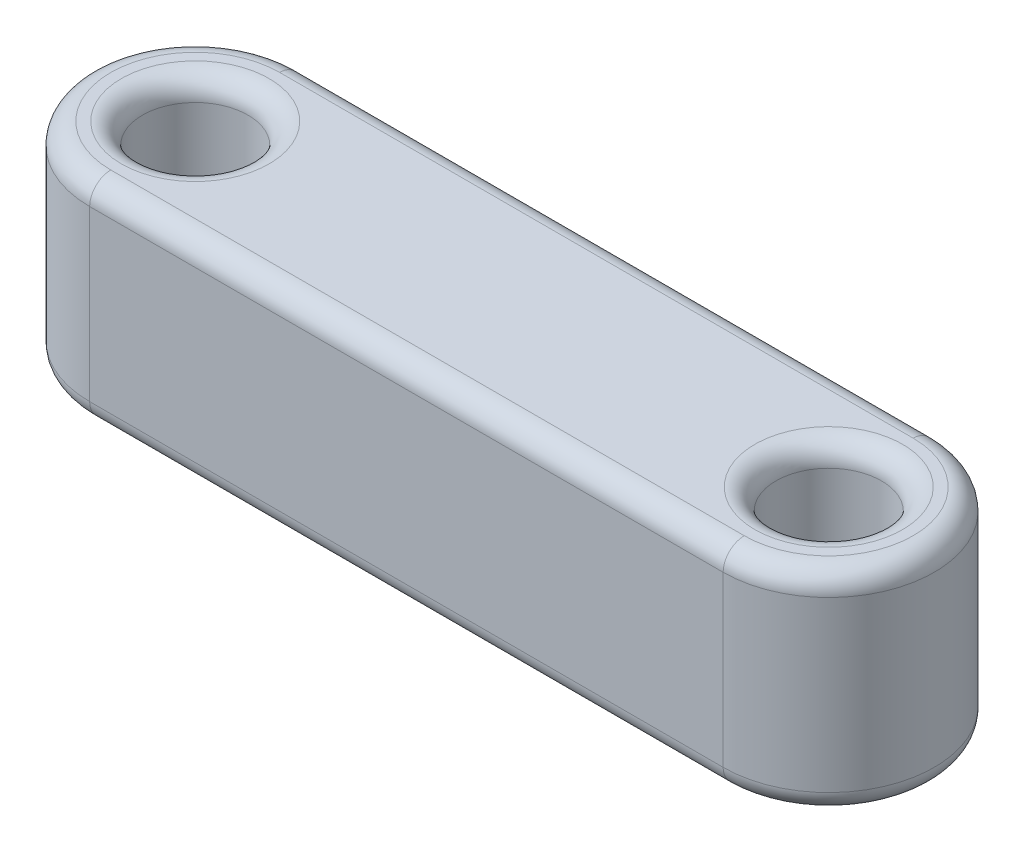
ISO-10303-21;
HEADER;
FILE_DESCRIPTION(('STEP AP214'),'2;1');
FILE_NAME('part.step','',(''),(''),'','','');
FILE_SCHEMA(('AUTOMOTIVE_DESIGN { 1 0 10303 214 1 1 1 1 }'));
ENDSEC;
DATA;
#1=APPLICATION_CONTEXT('core data for automotive mechanical design processes');
#2=APPLICATION_PROTOCOL_DEFINITION('international standard','automotive_design',2000,#1);
#3=PRODUCT_CONTEXT('',#1,'mechanical');
#4=PRODUCT('Part','Part','',(#3));
#5=PRODUCT_RELATED_PRODUCT_CATEGORY('part','',(#4));
#6=PRODUCT_DEFINITION_FORMATION('','',#4);
#7=PRODUCT_DEFINITION_CONTEXT('part definition',#1,'design');
#8=PRODUCT_DEFINITION('design','',#6,#7);
#9=PRODUCT_DEFINITION_SHAPE('','',#8);
#10=(LENGTH_UNIT() NAMED_UNIT(*) SI_UNIT(.MILLI.,.METRE.));
#11=(NAMED_UNIT(*) PLANE_ANGLE_UNIT() SI_UNIT($,.RADIAN.));
#12=(NAMED_UNIT(*) SI_UNIT($,.STERADIAN.) SOLID_ANGLE_UNIT());
#13=UNCERTAINTY_MEASURE_WITH_UNIT(LENGTH_MEASURE(1.E-05),#10,'distance_accuracy_value','');
#14=(GEOMETRIC_REPRESENTATION_CONTEXT(3) GLOBAL_UNCERTAINTY_ASSIGNED_CONTEXT((#13)) GLOBAL_UNIT_ASSIGNED_CONTEXT((#10,
#11,#12)) REPRESENTATION_CONTEXT('',''));
#15=CARTESIAN_POINT('',(0.,0.,0.));
#16=DIRECTION('',(0.,0.,1.));
#17=DIRECTION('',(1.,0.,0.));
#18=AXIS2_PLACEMENT_3D('',#15,#16,#17);
#19=CARTESIAN_POINT('',(0.,10.,0.));
#20=DIRECTION('',(0.,1.,0.));
#21=DIRECTION('',(0.,0.,1.));
#22=AXIS2_PLACEMENT_3D('',#19,#20,#21);
#23=PLANE('',#22);
#24=CARTESIAN_POINT('',(30.,10.,0.));
#25=DIRECTION('',(0.,1.,0.));
#26=DIRECTION('',(0.,0.,1.));
#27=AXIS2_PLACEMENT_3D('',#24,#25,#26);
#28=CIRCLE('',#27,3.5);
#29=CARTESIAN_POINT('',(30.,10.,3.5));
#30=VERTEX_POINT('',#29);
#31=EDGE_CURVE('E11',#30,#30,#28,.F.);
#32=ORIENTED_EDGE('',*,*,#31,.T.);
#33=EDGE_LOOP('',(#32));
#34=FACE_BOUND('',#33,.T.);
#35=CARTESIAN_POINT('',(30.,10.,0.));
#36=DIRECTION('',(0.,1.,0.));
#37=DIRECTION('',(0.,0.,1.));
#38=AXIS2_PLACEMENT_3D('',#35,#36,#37);
#39=CIRCLE('',#38,4.);
#40=CARTESIAN_POINT('',(30.,10.,4.));
#41=VERTEX_POINT('',#40);
#42=CARTESIAN_POINT('',(30.,10.,-4.));
#43=VERTEX_POINT('',#42);
#44=EDGE_CURVE('E57',#41,#43,#39,.T.);
#45=ORIENTED_EDGE('',*,*,#44,.T.);
#46=DIRECTION('',(-1.,0.,0.));
#47=VECTOR('',#46,1.);
#48=CARTESIAN_POINT('',(0.,10.,-4.));
#49=LINE('',#48,#47);
#50=CARTESIAN_POINT('',(0.,10.,-4.));
#51=VERTEX_POINT('',#50);
#52=EDGE_CURVE('E49',#43,#51,#49,.T.);
#53=ORIENTED_EDGE('',*,*,#52,.T.);
#54=CARTESIAN_POINT('',(0.,10.,0.));
#55=DIRECTION('',(0.,1.,0.));
#56=DIRECTION('',(0.,0.,1.));
#57=AXIS2_PLACEMENT_3D('',#54,#55,#56);
#58=CIRCLE('',#57,4.);
#59=CARTESIAN_POINT('',(0.,10.,4.));
#60=VERTEX_POINT('',#59);
#61=EDGE_CURVE('E194',#51,#60,#58,.T.);
#62=ORIENTED_EDGE('',*,*,#61,.T.);
#63=DIRECTION('',(1.,0.,0.));
#64=VECTOR('',#63,1.);
#65=CARTESIAN_POINT('',(30.,10.,4.));
#66=LINE('',#65,#64);
#67=EDGE_CURVE('E62',#60,#41,#66,.T.);
#68=ORIENTED_EDGE('',*,*,#67,.T.);
#69=EDGE_LOOP('',(#45,#53,#62,#68));
#70=FACE_BOUND('',#69,.T.);
#71=CARTESIAN_POINT('',(0.,10.,0.));
#72=DIRECTION('',(0.,1.,0.));
#73=DIRECTION('',(0.,0.,1.));
#74=AXIS2_PLACEMENT_3D('',#71,#72,#73);
#75=CIRCLE('',#74,3.5);
#76=CARTESIAN_POINT('',(0.,10.,3.5));
#77=VERTEX_POINT('',#76);
#78=EDGE_CURVE('E190',#77,#77,#75,.F.);
#79=ORIENTED_EDGE('',*,*,#78,.T.);
#80=EDGE_LOOP('',(#79));
#81=FACE_BOUND('',#80,.T.);
#82=ADVANCED_FACE('F39',(#34,#70,#81),#23,.T.);
#83=CARTESIAN_POINT('',(0.,0.,0.));
#84=DIRECTION('',(0.,1.,0.));
#85=DIRECTION('',(0.,0.,1.));
#86=AXIS2_PLACEMENT_3D('',#83,#84,#85);
#87=PLANE('',#86);
#88=CARTESIAN_POINT('',(30.,0.,0.));
#89=DIRECTION('',(0.,1.,0.));
#90=DIRECTION('',(0.,0.,1.));
#91=AXIS2_PLACEMENT_3D('',#88,#89,#90);
#92=CIRCLE('',#91,3.5);
#93=CARTESIAN_POINT('',(30.,0.,3.5));
#94=VERTEX_POINT('',#93);
#95=EDGE_CURVE('E142',#94,#94,#92,.T.);
#96=ORIENTED_EDGE('',*,*,#95,.T.);
#97=EDGE_LOOP('',(#96));
#98=FACE_BOUND('',#97,.T.);
#99=CARTESIAN_POINT('',(0.,0.,0.));
#100=DIRECTION('',(0.,1.,0.));
#101=DIRECTION('',(0.,0.,1.));
#102=AXIS2_PLACEMENT_3D('',#99,#100,#101);
#103=CIRCLE('',#102,3.5);
#104=CARTESIAN_POINT('',(0.,0.,3.5));
#105=VERTEX_POINT('',#104);
#106=EDGE_CURVE('E137',#105,#105,#103,.T.);
#107=ORIENTED_EDGE('',*,*,#106,.T.);
#108=EDGE_LOOP('',(#107));
#109=FACE_BOUND('',#108,.T.);
#110=CARTESIAN_POINT('',(30.,0.,0.));
#111=DIRECTION('',(0.,1.,0.));
#112=DIRECTION('',(0.,0.,1.));
#113=AXIS2_PLACEMENT_3D('',#110,#111,#112);
#114=CIRCLE('',#113,4.);
#115=CARTESIAN_POINT('',(30.,0.,-4.));
#116=VERTEX_POINT('',#115);
#117=CARTESIAN_POINT('',(30.,0.,4.));
#118=VERTEX_POINT('',#117);
#119=EDGE_CURVE('E135',#116,#118,#114,.F.);
#120=ORIENTED_EDGE('',*,*,#119,.T.);
#121=DIRECTION('',(1.,0.,0.));
#122=VECTOR('',#121,1.);
#123=CARTESIAN_POINT('',(0.,0.,4.));
#124=LINE('',#123,#122);
#125=CARTESIAN_POINT('',(0.,0.,4.));
#126=VERTEX_POINT('',#125);
#127=EDGE_CURVE('E112',#118,#126,#124,.F.);
#128=ORIENTED_EDGE('',*,*,#127,.T.);
#129=CARTESIAN_POINT('',(0.,0.,0.));
#130=DIRECTION('',(0.,1.,0.));
#131=DIRECTION('',(0.,0.,1.));
#132=AXIS2_PLACEMENT_3D('',#129,#130,#131);
#133=CIRCLE('',#132,4.);
#134=CARTESIAN_POINT('',(0.,0.,-4.));
#135=VERTEX_POINT('',#134);
#136=EDGE_CURVE('E123',#126,#135,#133,.F.);
#137=ORIENTED_EDGE('',*,*,#136,.T.);
#138=DIRECTION('',(-1.,0.,0.));
#139=VECTOR('',#138,1.);
#140=CARTESIAN_POINT('',(0.,0.,-4.));
#141=LINE('',#140,#139);
#142=EDGE_CURVE('E130',#135,#116,#141,.F.);
#143=ORIENTED_EDGE('',*,*,#142,.T.);
#144=EDGE_LOOP('',(#120,#128,#137,#143));
#145=FACE_BOUND('',#144,.T.);
#146=ADVANCED_FACE('F133',(#98,#109,#145),#87,.F.);
#147=CARTESIAN_POINT('',(0.,10.,0.));
#148=DIRECTION('',(0.,-1.,0.));
#149=DIRECTION('',(0.,0.,-1.));
#150=AXIS2_PLACEMENT_3D('',#147,#148,#149);
#151=CYLINDRICAL_SURFACE('',#150,5.);
#152=DIRECTION('',(0.,-1.,0.));
#153=VECTOR('',#152,1.);
#154=CARTESIAN_POINT('',(0.,10.,-5.));
#155=LINE('',#154,#153);
#156=CARTESIAN_POINT('',(0.,9.,-5.));
#157=VERTEX_POINT('',#156);
#158=CARTESIAN_POINT('',(0.,0.999999999999999,-5.));
#159=VERTEX_POINT('',#158);
#160=EDGE_CURVE('E210',#157,#159,#155,.T.);
#161=ORIENTED_EDGE('',*,*,#160,.T.);
#162=CARTESIAN_POINT('',(0.,0.999999999999999,0.));
#163=DIRECTION('',(0.,1.,0.));
#164=DIRECTION('',(0.,0.,1.));
#165=AXIS2_PLACEMENT_3D('',#162,#163,#164);
#166=CIRCLE('',#165,5.);
#167=CARTESIAN_POINT('',(0.,0.999999999999999,5.));
#168=VERTEX_POINT('',#167);
#169=EDGE_CURVE('E187',#159,#168,#166,.T.);
#170=ORIENTED_EDGE('',*,*,#169,.T.);
#171=DIRECTION('',(0.,-1.,0.));
#172=VECTOR('',#171,1.);
#173=CARTESIAN_POINT('',(0.,10.,5.));
#174=LINE('',#173,#172);
#175=CARTESIAN_POINT('',(0.,9.,5.));
#176=VERTEX_POINT('',#175);
#177=EDGE_CURVE('E131',#176,#168,#174,.T.);
#178=ORIENTED_EDGE('',*,*,#177,.F.);
#179=CARTESIAN_POINT('',(0.,9.,0.));
#180=DIRECTION('',(0.,1.,0.));
#181=DIRECTION('',(0.,0.,1.));
#182=AXIS2_PLACEMENT_3D('',#179,#180,#181);
#183=CIRCLE('',#182,5.);
#184=EDGE_CURVE('E184',#176,#157,#183,.F.);
#185=ORIENTED_EDGE('',*,*,#184,.T.);
#186=EDGE_LOOP('',(#161,#170,#178,#185));
#187=FACE_BOUND('',#186,.T.);
#188=ADVANCED_FACE('F240',(#187),#151,.T.);
#189=CARTESIAN_POINT('',(0.,10.,5.));
#190=DIRECTION('',(0.,0.,-1.));
#191=DIRECTION('',(-1.,0.,0.));
#192=AXIS2_PLACEMENT_3D('',#189,#190,#191);
#193=PLANE('',#192);
#194=ORIENTED_EDGE('',*,*,#177,.T.);
#195=DIRECTION('',(1.,0.,0.));
#196=VECTOR('',#195,1.);
#197=CARTESIAN_POINT('',(0.,0.999999999999999,5.));
#198=LINE('',#197,#196);
#199=CARTESIAN_POINT('',(30.,0.999999999999999,5.));
#200=VERTEX_POINT('',#199);
#201=EDGE_CURVE('E115',#168,#200,#198,.T.);
#202=ORIENTED_EDGE('',*,*,#201,.T.);
#203=DIRECTION('',(0.,-1.,0.));
#204=VECTOR('',#203,1.);
#205=CARTESIAN_POINT('',(30.,10.,5.));
#206=LINE('',#205,#204);
#207=CARTESIAN_POINT('',(30.,9.,5.));
#208=VERTEX_POINT('',#207);
#209=EDGE_CURVE('E237',#208,#200,#206,.T.);
#210=ORIENTED_EDGE('',*,*,#209,.F.);
#211=DIRECTION('',(1.,0.,0.));
#212=VECTOR('',#211,1.);
#213=CARTESIAN_POINT('',(0.,9.,5.));
#214=LINE('',#213,#212);
#215=EDGE_CURVE('E166',#208,#176,#214,.F.);
#216=ORIENTED_EDGE('',*,*,#215,.T.);
#217=EDGE_LOOP('',(#194,#202,#210,#216));
#218=FACE_BOUND('',#217,.T.);
#219=ADVANCED_FACE('F235',(#218),#193,.F.);
#220=CARTESIAN_POINT('',(30.,10.,0.));
#221=DIRECTION('',(0.,-1.,0.));
#222=DIRECTION('',(0.,0.,-1.));
#223=AXIS2_PLACEMENT_3D('',#220,#221,#222);
#224=CYLINDRICAL_SURFACE('',#223,5.);
#225=ORIENTED_EDGE('',*,*,#209,.T.);
#226=CARTESIAN_POINT('',(30.,0.999999999999999,0.));
#227=DIRECTION('',(0.,1.,0.));
#228=DIRECTION('',(0.,0.,1.));
#229=AXIS2_PLACEMENT_3D('',#226,#227,#228);
#230=CIRCLE('',#229,5.);
#231=CARTESIAN_POINT('',(30.,0.999999999999999,-5.));
#232=VERTEX_POINT('',#231);
#233=EDGE_CURVE('E174',#200,#232,#230,.T.);
#234=ORIENTED_EDGE('',*,*,#233,.T.);
#235=DIRECTION('',(0.,-1.,0.));
#236=VECTOR('',#235,1.);
#237=CARTESIAN_POINT('',(30.,10.,-5.));
#238=LINE('',#237,#236);
#239=CARTESIAN_POINT('',(30.,9.,-5.));
#240=VERTEX_POINT('',#239);
#241=EDGE_CURVE('E245',#240,#232,#238,.T.);
#242=ORIENTED_EDGE('',*,*,#241,.F.);
#243=CARTESIAN_POINT('',(30.,9.,0.));
#244=DIRECTION('',(0.,1.,0.));
#245=DIRECTION('',(0.,0.,1.));
#246=AXIS2_PLACEMENT_3D('',#243,#244,#245);
#247=CIRCLE('',#246,5.);
#248=EDGE_CURVE('E171',#240,#208,#247,.F.);
#249=ORIENTED_EDGE('',*,*,#248,.T.);
#250=EDGE_LOOP('',(#225,#234,#242,#249));
#251=FACE_BOUND('',#250,.T.);
#252=ADVANCED_FACE('F259',(#251),#224,.T.);
#253=CARTESIAN_POINT('',(0.,10.,-5.));
#254=DIRECTION('',(0.,0.,1.));
#255=DIRECTION('',(1.,0.,0.));
#256=AXIS2_PLACEMENT_3D('',#253,#254,#255);
#257=PLANE('',#256);
#258=ORIENTED_EDGE('',*,*,#241,.T.);
#259=DIRECTION('',(-1.,0.,0.));
#260=VECTOR('',#259,1.);
#261=CARTESIAN_POINT('',(0.,0.999999999999999,-5.));
#262=LINE('',#261,#260);
#263=EDGE_CURVE('E181',#232,#159,#262,.T.);
#264=ORIENTED_EDGE('',*,*,#263,.T.);
#265=ORIENTED_EDGE('',*,*,#160,.F.);
#266=DIRECTION('',(-1.,0.,0.));
#267=VECTOR('',#266,1.);
#268=CARTESIAN_POINT('',(30.,9.,-5.));
#269=LINE('',#268,#267);
#270=EDGE_CURVE('E177',#157,#240,#269,.F.);
#271=ORIENTED_EDGE('',*,*,#270,.T.);
#272=EDGE_LOOP('',(#258,#264,#265,#271));
#273=FACE_BOUND('',#272,.T.);
#274=ADVANCED_FACE('F265',(#273),#257,.F.);
#275=CARTESIAN_POINT('',(0.,10.,0.));
#276=DIRECTION('',(0.,-1.,0.));
#277=DIRECTION('',(0.,0.,-1.));
#278=AXIS2_PLACEMENT_3D('',#275,#276,#277);
#279=CYLINDRICAL_SURFACE('',#278,2.5);
#280=CARTESIAN_POINT('',(0.,0.999999999999999,0.));
#281=DIRECTION('',(0.,1.,0.));
#282=DIRECTION('',(0.,0.,1.));
#283=AXIS2_PLACEMENT_3D('',#280,#281,#282);
#284=CIRCLE('',#283,2.5);
#285=CARTESIAN_POINT('',(0.,0.999999999999999,2.5));
#286=VERTEX_POINT('',#285);
#287=EDGE_CURVE('E162',#286,#286,#284,.F.);
#288=ORIENTED_EDGE('',*,*,#287,.T.);
#289=EDGE_LOOP('',(#288));
#290=FACE_BOUND('',#289,.T.);
#291=CARTESIAN_POINT('',(0.,9.,0.));
#292=DIRECTION('',(0.,1.,0.));
#293=DIRECTION('',(0.,0.,1.));
#294=AXIS2_PLACEMENT_3D('',#291,#292,#293);
#295=CIRCLE('',#294,2.5);
#296=CARTESIAN_POINT('',(0.,9.,2.5));
#297=VERTEX_POINT('',#296);
#298=EDGE_CURVE('E158',#297,#297,#295,.T.);
#299=ORIENTED_EDGE('',*,*,#298,.T.);
#300=EDGE_LOOP('',(#299));
#301=FACE_BOUND('',#300,.T.);
#302=ADVANCED_FACE('F281',(#290,#301),#279,.F.);
#303=CARTESIAN_POINT('',(30.,10.,0.));
#304=DIRECTION('',(0.,-1.,0.));
#305=DIRECTION('',(0.,0.,-1.));
#306=AXIS2_PLACEMENT_3D('',#303,#304,#305);
#307=CYLINDRICAL_SURFACE('',#306,2.5);
#308=CARTESIAN_POINT('',(30.,0.999999999999999,0.));
#309=DIRECTION('',(0.,1.,0.));
#310=DIRECTION('',(0.,0.,1.));
#311=AXIS2_PLACEMENT_3D('',#308,#309,#310);
#312=CIRCLE('',#311,2.5);
#313=CARTESIAN_POINT('',(30.,0.999999999999999,2.5));
#314=VERTEX_POINT('',#313);
#315=EDGE_CURVE('E154',#314,#314,#312,.F.);
#316=ORIENTED_EDGE('',*,*,#315,.T.);
#317=EDGE_LOOP('',(#316));
#318=FACE_BOUND('',#317,.T.);
#319=CARTESIAN_POINT('',(30.,9.,0.));
#320=DIRECTION('',(0.,1.,0.));
#321=DIRECTION('',(0.,0.,1.));
#322=AXIS2_PLACEMENT_3D('',#319,#320,#321);
#323=CIRCLE('',#322,2.5);
#324=CARTESIAN_POINT('',(30.,9.,2.5));
#325=VERTEX_POINT('',#324);
#326=EDGE_CURVE('E150',#325,#325,#323,.T.);
#327=ORIENTED_EDGE('',*,*,#326,.T.);
#328=EDGE_LOOP('',(#327));
#329=FACE_BOUND('',#328,.T.);
#330=ADVANCED_FACE('F283',(#318,#329),#307,.F.);
#331=CARTESIAN_POINT('',(30.,0.999999999999999,0.));
#332=DIRECTION('',(0.,1.,0.));
#333=DIRECTION('',(0.,0.,1.));
#334=AXIS2_PLACEMENT_3D('',#331,#332,#333);
#335=TOROIDAL_SURFACE('',#334,3.5,1.);
#336=ORIENTED_EDGE('',*,*,#315,.F.);
#337=EDGE_LOOP('',(#336));
#338=FACE_BOUND('',#337,.T.);
#339=ORIENTED_EDGE('',*,*,#95,.F.);
#340=EDGE_LOOP('',(#339));
#341=FACE_BOUND('',#340,.T.);
#342=ADVANCED_FACE('F290',(#338,#341),#335,.T.);
#343=CARTESIAN_POINT('',(0.,0.999999999999999,0.));
#344=DIRECTION('',(0.,1.,0.));
#345=DIRECTION('',(0.,0.,1.));
#346=AXIS2_PLACEMENT_3D('',#343,#344,#345);
#347=TOROIDAL_SURFACE('',#346,3.5,1.);
#348=ORIENTED_EDGE('',*,*,#287,.F.);
#349=EDGE_LOOP('',(#348));
#350=FACE_BOUND('',#349,.T.);
#351=ORIENTED_EDGE('',*,*,#106,.F.);
#352=EDGE_LOOP('',(#351));
#353=FACE_BOUND('',#352,.T.);
#354=ADVANCED_FACE('F306',(#350,#353),#347,.T.);
#355=CARTESIAN_POINT('',(0.,0.999999999999999,-4.));
#356=DIRECTION('',(-1.,0.,0.));
#357=DIRECTION('',(0.,0.,1.));
#358=AXIS2_PLACEMENT_3D('',#355,#356,#357);
#359=CYLINDRICAL_SURFACE('',#358,1.);
#360=CARTESIAN_POINT('',(30.,1.,-4.));
#361=DIRECTION('',(1.,0.,0.));
#362=DIRECTION('',(0.,0.,-1.));
#363=AXIS2_PLACEMENT_3D('',#360,#361,#362);
#364=CIRCLE('',#363,1.);
#365=EDGE_CURVE('E119',#116,#232,#364,.T.);
#366=ORIENTED_EDGE('',*,*,#365,.F.);
#367=ORIENTED_EDGE('',*,*,#142,.F.);
#368=CARTESIAN_POINT('',(0.,0.999999999999999,-4.));
#369=DIRECTION('',(-1.,0.,0.));
#370=DIRECTION('',(0.,0.,1.));
#371=AXIS2_PLACEMENT_3D('',#368,#369,#370);
#372=CIRCLE('',#371,1.);
#373=EDGE_CURVE('E126',#159,#135,#372,.T.);
#374=ORIENTED_EDGE('',*,*,#373,.F.);
#375=ORIENTED_EDGE('',*,*,#263,.F.);
#376=EDGE_LOOP('',(#366,#367,#374,#375));
#377=FACE_BOUND('',#376,.T.);
#378=ADVANCED_FACE('F252',(#377),#359,.T.);
#379=CARTESIAN_POINT('',(0.,0.999999999999999,0.));
#380=DIRECTION('',(0.,1.,0.));
#381=DIRECTION('',(0.,0.,1.));
#382=AXIS2_PLACEMENT_3D('',#379,#380,#381);
#383=TOROIDAL_SURFACE('',#382,4.,1.);
#384=ORIENTED_EDGE('',*,*,#373,.T.);
#385=ORIENTED_EDGE('',*,*,#136,.F.);
#386=CARTESIAN_POINT('',(0.,0.999999999999999,4.));
#387=DIRECTION('',(1.,0.,0.));
#388=DIRECTION('',(0.,0.,-1.));
#389=AXIS2_PLACEMENT_3D('',#386,#387,#388);
#390=CIRCLE('',#389,1.);
#391=EDGE_CURVE('E108',#168,#126,#390,.T.);
#392=ORIENTED_EDGE('',*,*,#391,.F.);
#393=ORIENTED_EDGE('',*,*,#169,.F.);
#394=EDGE_LOOP('',(#384,#385,#392,#393));
#395=FACE_BOUND('',#394,.T.);
#396=ADVANCED_FACE('F124',(#395),#383,.T.);
#397=CARTESIAN_POINT('',(30.,0.999999999999999,0.));
#398=DIRECTION('',(0.,1.,0.));
#399=DIRECTION('',(0.,0.,1.));
#400=AXIS2_PLACEMENT_3D('',#397,#398,#399);
#401=TOROIDAL_SURFACE('',#400,4.,1.);
#402=ORIENTED_EDGE('',*,*,#365,.T.);
#403=ORIENTED_EDGE('',*,*,#233,.F.);
#404=CARTESIAN_POINT('',(30.,1.,4.));
#405=DIRECTION('',(-1.,0.,0.));
#406=DIRECTION('',(0.,0.,1.));
#407=AXIS2_PLACEMENT_3D('',#404,#405,#406);
#408=CIRCLE('',#407,1.);
#409=EDGE_CURVE('E120',#118,#200,#408,.T.);
#410=ORIENTED_EDGE('',*,*,#409,.F.);
#411=ORIENTED_EDGE('',*,*,#119,.F.);
#412=EDGE_LOOP('',(#402,#403,#410,#411));
#413=FACE_BOUND('',#412,.T.);
#414=ADVANCED_FACE('F255',(#413),#401,.T.);
#415=CARTESIAN_POINT('',(0.,0.999999999999999,4.));
#416=DIRECTION('',(1.,0.,0.));
#417=DIRECTION('',(0.,0.,-1.));
#418=AXIS2_PLACEMENT_3D('',#415,#416,#417);
#419=CYLINDRICAL_SURFACE('',#418,1.);
#420=ORIENTED_EDGE('',*,*,#391,.T.);
#421=ORIENTED_EDGE('',*,*,#127,.F.);
#422=ORIENTED_EDGE('',*,*,#409,.T.);
#423=ORIENTED_EDGE('',*,*,#201,.F.);
#424=EDGE_LOOP('',(#420,#421,#422,#423));
#425=FACE_BOUND('',#424,.T.);
#426=ADVANCED_FACE('F110',(#425),#419,.T.);
#427=CARTESIAN_POINT('',(30.,9.,0.));
#428=DIRECTION('',(0.,1.,0.));
#429=DIRECTION('',(0.,0.,1.));
#430=AXIS2_PLACEMENT_3D('',#427,#428,#429);
#431=TOROIDAL_SURFACE('',#430,3.5,1.);
#432=ORIENTED_EDGE('',*,*,#31,.F.);
#433=EDGE_LOOP('',(#432));
#434=FACE_BOUND('',#433,.T.);
#435=ORIENTED_EDGE('',*,*,#326,.F.);
#436=EDGE_LOOP('',(#435));
#437=FACE_BOUND('',#436,.T.);
#438=ADVANCED_FACE('F313',(#434,#437),#431,.T.);
#439=CARTESIAN_POINT('',(0.,9.,4.));
#440=DIRECTION('',(-1.,0.,0.));
#441=DIRECTION('',(0.,0.,1.));
#442=AXIS2_PLACEMENT_3D('',#439,#440,#441);
#443=CYLINDRICAL_SURFACE('',#442,1.);
#444=CARTESIAN_POINT('',(0.,9.,4.));
#445=DIRECTION('',(-1.,0.,0.));
#446=DIRECTION('',(0.,0.,1.));
#447=AXIS2_PLACEMENT_3D('',#444,#445,#446);
#448=CIRCLE('',#447,1.);
#449=EDGE_CURVE('E216',#176,#60,#448,.T.);
#450=ORIENTED_EDGE('',*,*,#449,.F.);
#451=ORIENTED_EDGE('',*,*,#215,.F.);
#452=CARTESIAN_POINT('',(30.,9.,4.));
#453=DIRECTION('',(1.,0.,0.));
#454=DIRECTION('',(0.,0.,-1.));
#455=AXIS2_PLACEMENT_3D('',#452,#453,#454);
#456=CIRCLE('',#455,1.);
#457=EDGE_CURVE('E43',#41,#208,#456,.T.);
#458=ORIENTED_EDGE('',*,*,#457,.F.);
#459=ORIENTED_EDGE('',*,*,#67,.F.);
#460=EDGE_LOOP('',(#450,#451,#458,#459));
#461=FACE_BOUND('',#460,.T.);
#462=ADVANCED_FACE('F230',(#461),#443,.T.);
#463=CARTESIAN_POINT('',(30.,9.,0.));
#464=DIRECTION('',(0.,1.,0.));
#465=DIRECTION('',(0.,0.,1.));
#466=AXIS2_PLACEMENT_3D('',#463,#464,#465);
#467=TOROIDAL_SURFACE('',#466,4.,1.);
#468=ORIENTED_EDGE('',*,*,#457,.T.);
#469=ORIENTED_EDGE('',*,*,#248,.F.);
#470=CARTESIAN_POINT('',(30.,9.,-4.));
#471=DIRECTION('',(-1.,0.,0.));
#472=DIRECTION('',(0.,0.,1.));
#473=AXIS2_PLACEMENT_3D('',#470,#471,#472);
#474=CIRCLE('',#473,1.);
#475=EDGE_CURVE('E214',#43,#240,#474,.T.);
#476=ORIENTED_EDGE('',*,*,#475,.F.);
#477=ORIENTED_EDGE('',*,*,#44,.F.);
#478=EDGE_LOOP('',(#468,#469,#476,#477));
#479=FACE_BOUND('',#478,.T.);
#480=ADVANCED_FACE('F227',(#479),#467,.T.);
#481=CARTESIAN_POINT('',(0.,9.,0.));
#482=DIRECTION('',(0.,1.,0.));
#483=DIRECTION('',(0.,0.,1.));
#484=AXIS2_PLACEMENT_3D('',#481,#482,#483);
#485=TOROIDAL_SURFACE('',#484,4.,1.);
#486=ORIENTED_EDGE('',*,*,#449,.T.);
#487=ORIENTED_EDGE('',*,*,#61,.F.);
#488=CARTESIAN_POINT('',(0.,9.,-4.));
#489=DIRECTION('',(1.,0.,0.));
#490=DIRECTION('',(0.,0.,-1.));
#491=AXIS2_PLACEMENT_3D('',#488,#489,#490);
#492=CIRCLE('',#491,1.);
#493=EDGE_CURVE('E211',#157,#51,#492,.T.);
#494=ORIENTED_EDGE('',*,*,#493,.F.);
#495=ORIENTED_EDGE('',*,*,#184,.F.);
#496=EDGE_LOOP('',(#486,#487,#494,#495));
#497=FACE_BOUND('',#496,.T.);
#498=ADVANCED_FACE('F270',(#497),#485,.T.);
#499=CARTESIAN_POINT('',(0.,9.,-4.));
#500=DIRECTION('',(1.,0.,0.));
#501=DIRECTION('',(0.,0.,-1.));
#502=AXIS2_PLACEMENT_3D('',#499,#500,#501);
#503=CYLINDRICAL_SURFACE('',#502,1.);
#504=ORIENTED_EDGE('',*,*,#475,.T.);
#505=ORIENTED_EDGE('',*,*,#270,.F.);
#506=ORIENTED_EDGE('',*,*,#493,.T.);
#507=ORIENTED_EDGE('',*,*,#52,.F.);
#508=EDGE_LOOP('',(#504,#505,#506,#507));
#509=FACE_BOUND('',#508,.T.);
#510=ADVANCED_FACE('F268',(#509),#503,.T.);
#511=CARTESIAN_POINT('',(0.,9.,0.));
#512=DIRECTION('',(0.,1.,0.));
#513=DIRECTION('',(0.,0.,1.));
#514=AXIS2_PLACEMENT_3D('',#511,#512,#513);
#515=TOROIDAL_SURFACE('',#514,3.5,1.);
#516=ORIENTED_EDGE('',*,*,#78,.F.);
#517=EDGE_LOOP('',(#516));
#518=FACE_BOUND('',#517,.T.);
#519=ORIENTED_EDGE('',*,*,#298,.F.);
#520=EDGE_LOOP('',(#519));
#521=FACE_BOUND('',#520,.T.);
#522=ADVANCED_FACE('F41',(#518,#521),#515,.T.);
#523=CLOSED_SHELL('',(#82,#146,#188,#219,#252,#274,#302,#330,#342,#354,#378,#396,#414,#426,#438,
#462,#480,#498,#510,#522));
#524=MANIFOLD_SOLID_BREP('B2',#523);
#525=ADVANCED_BREP_SHAPE_REPRESENTATION('',(#18,#524),#14);
#526=SHAPE_DEFINITION_REPRESENTATION(#9,#525);
ENDSEC;
END-ISO-10303-21;
